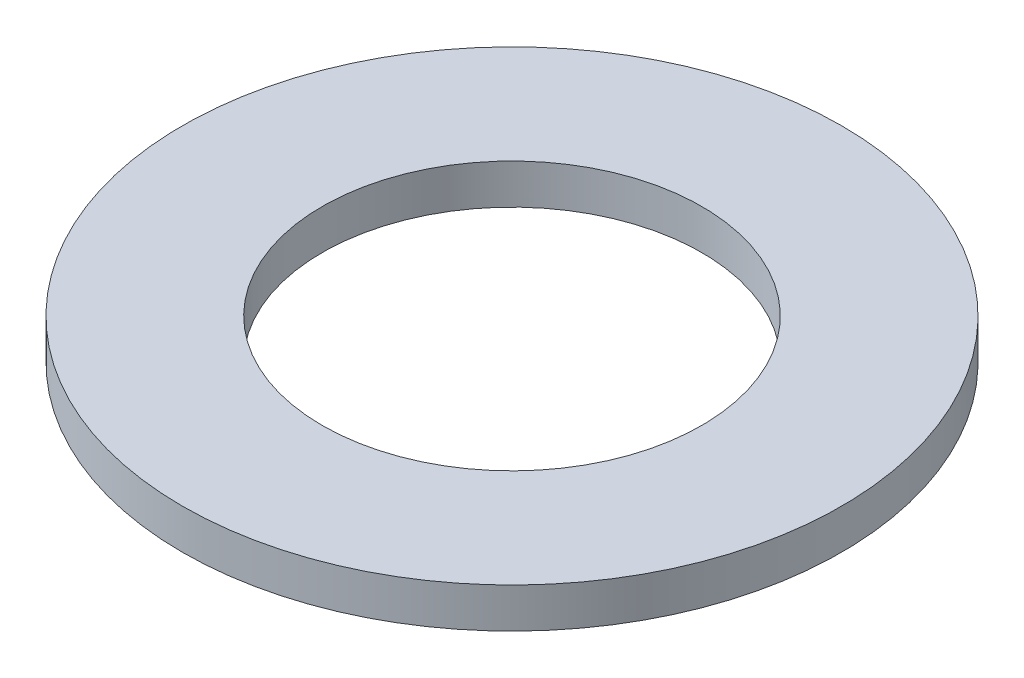
ISO-10303-21;
HEADER;
FILE_DESCRIPTION(('STEP AP214'),'2;1');
FILE_NAME('part.step','',(''),(''),'','','');
FILE_SCHEMA(('AUTOMOTIVE_DESIGN { 1 0 10303 214 1 1 1 1 }'));
ENDSEC;
DATA;
#1=APPLICATION_CONTEXT('core data for automotive mechanical design processes');
#2=APPLICATION_PROTOCOL_DEFINITION('international standard','automotive_design',2000,#1);
#3=PRODUCT_CONTEXT('',#1,'mechanical');
#4=PRODUCT('Part','Part','',(#3));
#5=PRODUCT_RELATED_PRODUCT_CATEGORY('part','',(#4));
#6=PRODUCT_DEFINITION_FORMATION('','',#4);
#7=PRODUCT_DEFINITION_CONTEXT('part definition',#1,'design');
#8=PRODUCT_DEFINITION('design','',#6,#7);
#9=PRODUCT_DEFINITION_SHAPE('','',#8);
#10=(LENGTH_UNIT() NAMED_UNIT(*) SI_UNIT(.MILLI.,.METRE.));
#11=(NAMED_UNIT(*) PLANE_ANGLE_UNIT() SI_UNIT($,.RADIAN.));
#12=(NAMED_UNIT(*) SI_UNIT($,.STERADIAN.) SOLID_ANGLE_UNIT());
#13=UNCERTAINTY_MEASURE_WITH_UNIT(LENGTH_MEASURE(1.E-05),#10,'distance_accuracy_value','');
#14=(GEOMETRIC_REPRESENTATION_CONTEXT(3) GLOBAL_UNCERTAINTY_ASSIGNED_CONTEXT((#13)) GLOBAL_UNIT_ASSIGNED_CONTEXT((#10,
#11,#12)) REPRESENTATION_CONTEXT('',''));
#15=CARTESIAN_POINT('',(0.,0.,0.));
#16=DIRECTION('',(0.,0.,1.));
#17=DIRECTION('',(1.,0.,0.));
#18=AXIS2_PLACEMENT_3D('',#15,#16,#17);
#19=CARTESIAN_POINT('',(0.,10.,0.));
#20=DIRECTION('',(0.,-1.,0.));
#21=DIRECTION('',(0.,0.,-1.));
#22=AXIS2_PLACEMENT_3D('',#19,#20,#21);
#23=CYLINDRICAL_SURFACE('',#22,82.5);
#24=CARTESIAN_POINT('',(0.,10.,0.));
#25=DIRECTION('',(0.,1.,0.));
#26=DIRECTION('',(0.,0.,1.));
#27=AXIS2_PLACEMENT_3D('',#24,#25,#26);
#28=CIRCLE('',#27,82.5);
#29=CARTESIAN_POINT('',(0.,10.,82.5));
#30=VERTEX_POINT('',#29);
#31=EDGE_CURVE('E10',#30,#30,#28,.T.);
#32=ORIENTED_EDGE('',*,*,#31,.F.);
#33=EDGE_LOOP('',(#32));
#34=FACE_BOUND('',#33,.T.);
#35=CARTESIAN_POINT('',(0.,0.,0.));
#36=DIRECTION('',(0.,1.,0.));
#37=DIRECTION('',(0.,0.,1.));
#38=AXIS2_PLACEMENT_3D('',#35,#36,#37);
#39=CIRCLE('',#38,82.5);
#40=CARTESIAN_POINT('',(0.,0.,82.5));
#41=VERTEX_POINT('',#40);
#42=EDGE_CURVE('E37',#41,#41,#39,.T.);
#43=ORIENTED_EDGE('',*,*,#42,.T.);
#44=EDGE_LOOP('',(#43));
#45=FACE_BOUND('',#44,.T.);
#46=ADVANCED_FACE('F40',(#34,#45),#23,.T.);
#47=CARTESIAN_POINT('',(0.,10.,0.));
#48=DIRECTION('',(0.,1.,0.));
#49=DIRECTION('',(0.,0.,1.));
#50=AXIS2_PLACEMENT_3D('',#47,#48,#49);
#51=PLANE('',#50);
#52=CARTESIAN_POINT('',(0.,10.,0.));
#53=DIRECTION('',(0.,1.,0.));
#54=DIRECTION('',(0.,0.,1.));
#55=AXIS2_PLACEMENT_3D('',#52,#53,#54);
#56=CIRCLE('',#55,47.5);
#57=CARTESIAN_POINT('',(0.,10.,47.5));
#58=VERTEX_POINT('',#57);
#59=EDGE_CURVE('E50',#58,#58,#56,.T.);
#60=ORIENTED_EDGE('',*,*,#59,.F.);
#61=EDGE_LOOP('',(#60));
#62=FACE_BOUND('',#61,.T.);
#63=ORIENTED_EDGE('',*,*,#31,.T.);
#64=EDGE_LOOP('',(#63));
#65=FACE_BOUND('',#64,.T.);
#66=ADVANCED_FACE('F59',(#62,#65),#51,.T.);
#67=CARTESIAN_POINT('',(0.,0.,0.));
#68=DIRECTION('',(0.,1.,0.));
#69=DIRECTION('',(0.,0.,1.));
#70=AXIS2_PLACEMENT_3D('',#67,#68,#69);
#71=PLANE('',#70);
#72=CARTESIAN_POINT('',(0.,0.,0.));
#73=DIRECTION('',(0.,1.,0.));
#74=DIRECTION('',(0.,0.,1.));
#75=AXIS2_PLACEMENT_3D('',#72,#73,#74);
#76=CIRCLE('',#75,47.5);
#77=CARTESIAN_POINT('',(0.,0.,47.5));
#78=VERTEX_POINT('',#77);
#79=EDGE_CURVE('E47',#78,#78,#76,.T.);
#80=ORIENTED_EDGE('',*,*,#79,.T.);
#81=EDGE_LOOP('',(#80));
#82=FACE_BOUND('',#81,.T.);
#83=ORIENTED_EDGE('',*,*,#42,.F.);
#84=EDGE_LOOP('',(#83));
#85=FACE_BOUND('',#84,.T.);
#86=ADVANCED_FACE('F58',(#82,#85),#71,.F.);
#87=CARTESIAN_POINT('',(0.,10.,0.));
#88=DIRECTION('',(0.,-1.,0.));
#89=DIRECTION('',(0.,0.,-1.));
#90=AXIS2_PLACEMENT_3D('',#87,#88,#89);
#91=CYLINDRICAL_SURFACE('',#90,47.5);
#92=ORIENTED_EDGE('',*,*,#59,.T.);
#93=EDGE_LOOP('',(#92));
#94=FACE_BOUND('',#93,.T.);
#95=ORIENTED_EDGE('',*,*,#79,.F.);
#96=EDGE_LOOP('',(#95));
#97=FACE_BOUND('',#96,.T.);
#98=ADVANCED_FACE('F54',(#94,#97),#91,.F.);
#99=CLOSED_SHELL('',(#46,#66,#86,#98));
#100=MANIFOLD_SOLID_BREP('B2',#99);
#101=ADVANCED_BREP_SHAPE_REPRESENTATION('',(#18,#100),#14);
#102=SHAPE_DEFINITION_REPRESENTATION(#9,#101);
ENDSEC;
END-ISO-10303-21;
